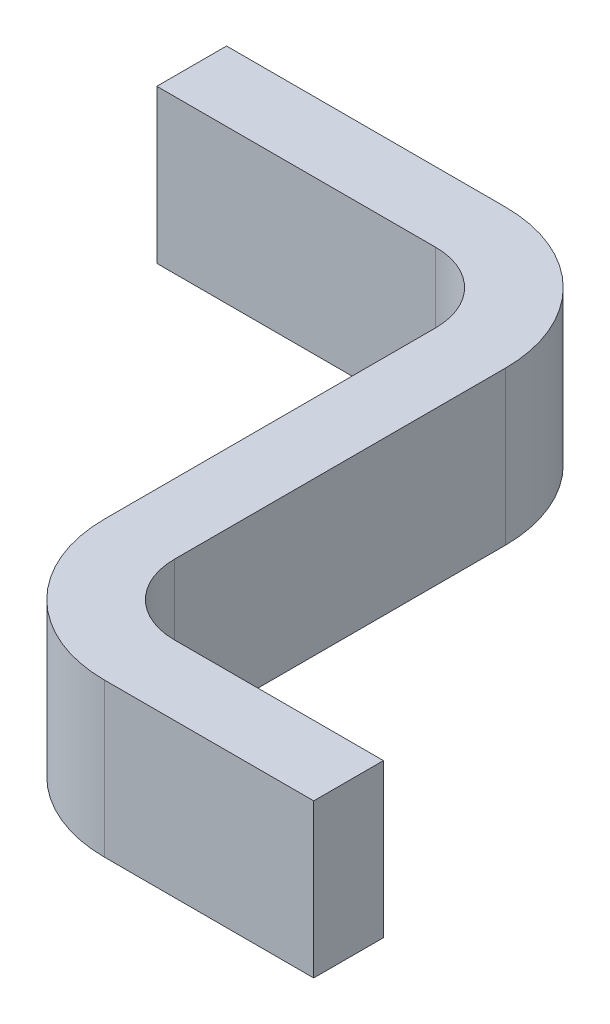
ISO-10303-21;
HEADER;
FILE_DESCRIPTION(('STEP AP214'),'2;1');
FILE_NAME('part.step','',(''),(''),'','','');
FILE_SCHEMA(('AUTOMOTIVE_DESIGN { 1 0 10303 214 1 1 1 1 }'));
ENDSEC;
DATA;
#1=APPLICATION_CONTEXT('core data for automotive mechanical design processes');
#2=APPLICATION_PROTOCOL_DEFINITION('international standard','automotive_design',2000,#1);
#3=PRODUCT_CONTEXT('',#1,'mechanical');
#4=PRODUCT('Part','Part','',(#3));
#5=PRODUCT_RELATED_PRODUCT_CATEGORY('part','',(#4));
#6=PRODUCT_DEFINITION_FORMATION('','',#4);
#7=PRODUCT_DEFINITION_CONTEXT('part definition',#1,'design');
#8=PRODUCT_DEFINITION('design','',#6,#7);
#9=PRODUCT_DEFINITION_SHAPE('','',#8);
#10=(LENGTH_UNIT() NAMED_UNIT(*) SI_UNIT(.MILLI.,.METRE.));
#11=(NAMED_UNIT(*) PLANE_ANGLE_UNIT() SI_UNIT($,.RADIAN.));
#12=(NAMED_UNIT(*) SI_UNIT($,.STERADIAN.) SOLID_ANGLE_UNIT());
#13=UNCERTAINTY_MEASURE_WITH_UNIT(LENGTH_MEASURE(1.E-05),#10,'distance_accuracy_value','');
#14=(GEOMETRIC_REPRESENTATION_CONTEXT(3) GLOBAL_UNCERTAINTY_ASSIGNED_CONTEXT((#13)) GLOBAL_UNIT_ASSIGNED_CONTEXT((#10,
#11,#12)) REPRESENTATION_CONTEXT('',''));
#15=CARTESIAN_POINT('',(0.,0.,0.));
#16=DIRECTION('',(0.,0.,1.));
#17=DIRECTION('',(1.,0.,0.));
#18=AXIS2_PLACEMENT_3D('',#15,#16,#17);
#19=CARTESIAN_POINT('',(-4.,2.86,0.675));
#20=DIRECTION('',(0.,-1.,0.));
#21=DIRECTION('',(1.,0.,0.));
#22=AXIS2_PLACEMENT_3D('',#19,#20,#21);
#23=PLANE('',#22);
#24=CARTESIAN_POINT('',(-3.8,2.86,0.675));
#25=DIRECTION('',(0.,1.,0.));
#26=DIRECTION('',(-1.,0.,0.));
#27=AXIS2_PLACEMENT_3D('',#24,#25,#26);
#28=CIRCLE('',#27,0.2);
#29=CARTESIAN_POINT('',(-3.8,2.86,0.875));
#30=VERTEX_POINT('',#29);
#31=CARTESIAN_POINT('',(-4.,2.86,0.675));
#32=VERTEX_POINT('',#31);
#33=EDGE_CURVE('E150',#30,#32,#28,.F.);
#34=ORIENTED_EDGE('',*,*,#33,.F.);
#35=DIRECTION('',(-1.,0.,0.));
#36=VECTOR('',#35,1.);
#37=CARTESIAN_POINT('',(-3.5,2.86,0.875));
#38=LINE('',#37,#36);
#39=CARTESIAN_POINT('',(-3.5,2.86,0.875));
#40=VERTEX_POINT('',#39);
#41=EDGE_CURVE('E147',#30,#40,#38,.F.);
#42=ORIENTED_EDGE('',*,*,#41,.T.);
#43=DIRECTION('',(0.,0.,1.));
#44=VECTOR('',#43,1.);
#45=CARTESIAN_POINT('',(-3.5,2.86,0.775));
#46=LINE('',#45,#44);
#47=CARTESIAN_POINT('',(-3.5,2.86,0.775));
#48=VERTEX_POINT('',#47);
#49=EDGE_CURVE('E141',#48,#40,#46,.T.);
#50=ORIENTED_EDGE('',*,*,#49,.F.);
#51=DIRECTION('',(1.,0.,0.));
#52=VECTOR('',#51,1.);
#53=CARTESIAN_POINT('',(-3.5,2.86,0.775));
#54=LINE('',#53,#52);
#55=CARTESIAN_POINT('',(-3.8,2.86,0.775));
#56=VERTEX_POINT('',#55);
#57=EDGE_CURVE('E115',#48,#56,#54,.F.);
#58=ORIENTED_EDGE('',*,*,#57,.T.);
#59=CARTESIAN_POINT('',(-3.8,2.86,0.675));
#60=DIRECTION('',(0.,1.,0.));
#61=DIRECTION('',(-1.,0.,0.));
#62=AXIS2_PLACEMENT_3D('',#59,#60,#61);
#63=CIRCLE('',#62,0.1);
#64=CARTESIAN_POINT('',(-3.9,2.86,0.675));
#65=VERTEX_POINT('',#64);
#66=EDGE_CURVE('E215',#56,#65,#63,.F.);
#67=ORIENTED_EDGE('',*,*,#66,.T.);
#68=DIRECTION('',(0.,0.,1.));
#69=VECTOR('',#68,1.);
#70=CARTESIAN_POINT('',(-3.9,2.86,0.675));
#71=LINE('',#70,#69);
#72=CARTESIAN_POINT('',(-3.9,2.86,0.2));
#73=VERTEX_POINT('',#72);
#74=EDGE_CURVE('E181',#65,#73,#71,.F.);
#75=ORIENTED_EDGE('',*,*,#74,.T.);
#76=CARTESIAN_POINT('',(-4.1,2.86,0.2));
#77=DIRECTION('',(0.,-1.,0.));
#78=DIRECTION('',(1.,0.,0.));
#79=AXIS2_PLACEMENT_3D('',#76,#77,#78);
#80=CIRCLE('',#79,0.2);
#81=CARTESIAN_POINT('',(-4.1,2.86,0.));
#82=VERTEX_POINT('',#81);
#83=EDGE_CURVE('E20',#82,#73,#80,.T.);
#84=ORIENTED_EDGE('',*,*,#83,.F.);
#85=DIRECTION('',(1.,0.,0.));
#86=VECTOR('',#85,1.);
#87=CARTESIAN_POINT('',(-4.1,2.86,0.));
#88=LINE('',#87,#86);
#89=CARTESIAN_POINT('',(-4.5,2.86,0.));
#90=VERTEX_POINT('',#89);
#91=EDGE_CURVE('E91',#82,#90,#88,.F.);
#92=ORIENTED_EDGE('',*,*,#91,.T.);
#93=DIRECTION('',(0.,0.,1.));
#94=VECTOR('',#93,1.);
#95=CARTESIAN_POINT('',(-4.5,2.86,0.));
#96=LINE('',#95,#94);
#97=CARTESIAN_POINT('',(-4.5,2.86,0.1));
#98=VERTEX_POINT('',#97);
#99=EDGE_CURVE('E163',#90,#98,#96,.T.);
#100=ORIENTED_EDGE('',*,*,#99,.T.);
#101=DIRECTION('',(-1.,0.,0.));
#102=VECTOR('',#101,1.);
#103=CARTESIAN_POINT('',(-4.1,2.86,0.1));
#104=LINE('',#103,#102);
#105=CARTESIAN_POINT('',(-4.1,2.86,0.1));
#106=VERTEX_POINT('',#105);
#107=EDGE_CURVE('E159',#98,#106,#104,.F.);
#108=ORIENTED_EDGE('',*,*,#107,.T.);
#109=CARTESIAN_POINT('',(-4.1,2.86,0.2));
#110=DIRECTION('',(0.,-1.,0.));
#111=DIRECTION('',(1.,0.,0.));
#112=AXIS2_PLACEMENT_3D('',#109,#110,#111);
#113=CIRCLE('',#112,0.1);
#114=CARTESIAN_POINT('',(-4.,2.86,0.2));
#115=VERTEX_POINT('',#114);
#116=EDGE_CURVE('E155',#106,#115,#113,.T.);
#117=ORIENTED_EDGE('',*,*,#116,.T.);
#118=DIRECTION('',(0.,0.,1.));
#119=VECTOR('',#118,1.);
#120=CARTESIAN_POINT('',(-4.,2.86,0.675));
#121=LINE('',#120,#119);
#122=EDGE_CURVE('E154',#115,#32,#121,.T.);
#123=ORIENTED_EDGE('',*,*,#122,.T.);
#124=EDGE_LOOP('',(#34,#42,#50,#58,#67,#75,#84,#92,#100,#108,#117,#123));
#125=FACE_BOUND('',#124,.T.);
#126=ADVANCED_FACE('F17',(#125),#23,.F.);
#127=CARTESIAN_POINT('',(-4.1,2.86,0.2));
#128=DIRECTION('',(0.,-1.,0.));
#129=DIRECTION('',(1.,0.,0.));
#130=AXIS2_PLACEMENT_3D('',#127,#128,#129);
#131=CYLINDRICAL_SURFACE('',#130,0.2);
#132=CARTESIAN_POINT('',(-4.1,2.64,0.2));
#133=DIRECTION('',(0.,-1.,0.));
#134=DIRECTION('',(1.,0.,0.));
#135=AXIS2_PLACEMENT_3D('',#132,#133,#134);
#136=CIRCLE('',#135,0.2);
#137=CARTESIAN_POINT('',(-3.9,2.64,0.2));
#138=VERTEX_POINT('',#137);
#139=CARTESIAN_POINT('',(-4.1,2.64,0.));
#140=VERTEX_POINT('',#139);
#141=EDGE_CURVE('E183',#138,#140,#136,.F.);
#142=ORIENTED_EDGE('',*,*,#141,.T.);
#143=DIRECTION('',(0.,1.,0.));
#144=VECTOR('',#143,1.);
#145=CARTESIAN_POINT('',(-4.1,2.86,0.));
#146=LINE('',#145,#144);
#147=EDGE_CURVE('E178',#140,#82,#146,.T.);
#148=ORIENTED_EDGE('',*,*,#147,.T.);
#149=ORIENTED_EDGE('',*,*,#83,.T.);
#150=DIRECTION('',(0.,-1.,0.));
#151=VECTOR('',#150,1.);
#152=CARTESIAN_POINT('',(-3.9,2.86,0.2));
#153=LINE('',#152,#151);
#154=EDGE_CURVE('E217',#73,#138,#153,.T.);
#155=ORIENTED_EDGE('',*,*,#154,.T.);
#156=EDGE_LOOP('',(#142,#148,#149,#155));
#157=FACE_BOUND('',#156,.T.);
#158=ADVANCED_FACE('F254',(#157),#131,.T.);
#159=CARTESIAN_POINT('',(-4.1,2.86,0.));
#160=DIRECTION('',(0.,0.,1.));
#161=DIRECTION('',(1.,0.,0.));
#162=AXIS2_PLACEMENT_3D('',#159,#160,#161);
#163=PLANE('',#162);
#164=ORIENTED_EDGE('',*,*,#147,.F.);
#165=DIRECTION('',(-1.,0.,0.));
#166=VECTOR('',#165,1.);
#167=CARTESIAN_POINT('',(-3.9,2.64,0.));
#168=LINE('',#167,#166);
#169=CARTESIAN_POINT('',(-4.5,2.64,0.));
#170=VERTEX_POINT('',#169);
#171=EDGE_CURVE('E170',#140,#170,#168,.T.);
#172=ORIENTED_EDGE('',*,*,#171,.T.);
#173=DIRECTION('',(0.,1.,0.));
#174=VECTOR('',#173,1.);
#175=CARTESIAN_POINT('',(-4.5,2.86,0.));
#176=LINE('',#175,#174);
#177=EDGE_CURVE('E173',#170,#90,#176,.T.);
#178=ORIENTED_EDGE('',*,*,#177,.T.);
#179=ORIENTED_EDGE('',*,*,#91,.F.);
#180=EDGE_LOOP('',(#164,#172,#178,#179));
#181=FACE_BOUND('',#180,.T.);
#182=ADVANCED_FACE('F257',(#181),#163,.F.);
#183=CARTESIAN_POINT('',(-4.5,2.86,0.));
#184=DIRECTION('',(1.,0.,0.));
#185=DIRECTION('',(0.,1.,0.));
#186=AXIS2_PLACEMENT_3D('',#183,#184,#185);
#187=PLANE('',#186);
#188=DIRECTION('',(0.,1.,0.));
#189=VECTOR('',#188,1.);
#190=CARTESIAN_POINT('',(-4.5,2.64,0.1));
#191=LINE('',#190,#189);
#192=CARTESIAN_POINT('',(-4.5,2.64,0.1));
#193=VERTEX_POINT('',#192);
#194=EDGE_CURVE('E160',#193,#98,#191,.T.);
#195=ORIENTED_EDGE('',*,*,#194,.T.);
#196=ORIENTED_EDGE('',*,*,#99,.F.);
#197=ORIENTED_EDGE('',*,*,#177,.F.);
#198=DIRECTION('',(0.,0.,1.));
#199=VECTOR('',#198,1.);
#200=CARTESIAN_POINT('',(-4.5,2.64,0.675));
#201=LINE('',#200,#199);
#202=EDGE_CURVE('E166',#170,#193,#201,.T.);
#203=ORIENTED_EDGE('',*,*,#202,.T.);
#204=EDGE_LOOP('',(#195,#196,#197,#203));
#205=FACE_BOUND('',#204,.T.);
#206=ADVANCED_FACE('F259',(#205),#187,.F.);
#207=CARTESIAN_POINT('',(-4.1,2.64,0.1));
#208=DIRECTION('',(0.,0.,-1.));
#209=DIRECTION('',(-1.,0.,0.));
#210=AXIS2_PLACEMENT_3D('',#207,#208,#209);
#211=PLANE('',#210);
#212=DIRECTION('',(0.,-1.,0.));
#213=VECTOR('',#212,1.);
#214=CARTESIAN_POINT('',(-4.1,2.64,0.1));
#215=LINE('',#214,#213);
#216=CARTESIAN_POINT('',(-4.1,2.64,0.1));
#217=VERTEX_POINT('',#216);
#218=EDGE_CURVE('E156',#217,#106,#215,.F.);
#219=ORIENTED_EDGE('',*,*,#218,.T.);
#220=ORIENTED_EDGE('',*,*,#107,.F.);
#221=ORIENTED_EDGE('',*,*,#194,.F.);
#222=DIRECTION('',(-1.,0.,0.));
#223=VECTOR('',#222,1.);
#224=CARTESIAN_POINT('',(-3.9,2.64,0.1));
#225=LINE('',#224,#223);
#226=EDGE_CURVE('E169',#193,#217,#225,.F.);
#227=ORIENTED_EDGE('',*,*,#226,.T.);
#228=EDGE_LOOP('',(#219,#220,#221,#227));
#229=FACE_BOUND('',#228,.T.);
#230=ADVANCED_FACE('F234',(#229),#211,.F.);
#231=CARTESIAN_POINT('',(-4.1,2.64,0.2));
#232=DIRECTION('',(0.,-1.,0.));
#233=DIRECTION('',(1.,0.,0.));
#234=AXIS2_PLACEMENT_3D('',#231,#232,#233);
#235=CYLINDRICAL_SURFACE('',#234,0.1);
#236=DIRECTION('',(0.,1.,0.));
#237=VECTOR('',#236,1.);
#238=CARTESIAN_POINT('',(-4.,2.64,0.2));
#239=LINE('',#238,#237);
#240=CARTESIAN_POINT('',(-4.,2.64,0.2));
#241=VERTEX_POINT('',#240);
#242=EDGE_CURVE('E151',#241,#115,#239,.T.);
#243=ORIENTED_EDGE('',*,*,#242,.T.);
#244=ORIENTED_EDGE('',*,*,#116,.F.);
#245=ORIENTED_EDGE('',*,*,#218,.F.);
#246=CARTESIAN_POINT('',(-4.1,2.64,0.2));
#247=DIRECTION('',(0.,-1.,0.));
#248=DIRECTION('',(1.,0.,0.));
#249=AXIS2_PLACEMENT_3D('',#246,#247,#248);
#250=CIRCLE('',#249,0.1);
#251=EDGE_CURVE('E210',#217,#241,#250,.T.);
#252=ORIENTED_EDGE('',*,*,#251,.T.);
#253=EDGE_LOOP('',(#243,#244,#245,#252));
#254=FACE_BOUND('',#253,.T.);
#255=ADVANCED_FACE('F227',(#254),#235,.F.);
#256=CARTESIAN_POINT('',(-4.,2.64,0.675));
#257=DIRECTION('',(1.,0.,0.));
#258=DIRECTION('',(0.,1.,0.));
#259=AXIS2_PLACEMENT_3D('',#256,#257,#258);
#260=PLANE('',#259);
#261=DIRECTION('',(0.,1.,0.));
#262=VECTOR('',#261,1.);
#263=CARTESIAN_POINT('',(-4.,2.64,0.675));
#264=LINE('',#263,#262);
#265=CARTESIAN_POINT('',(-4.,2.64,0.675));
#266=VERTEX_POINT('',#265);
#267=EDGE_CURVE('E148',#32,#266,#264,.F.);
#268=ORIENTED_EDGE('',*,*,#267,.F.);
#269=ORIENTED_EDGE('',*,*,#122,.F.);
#270=ORIENTED_EDGE('',*,*,#242,.F.);
#271=DIRECTION('',(0.,0.,1.));
#272=VECTOR('',#271,1.);
#273=CARTESIAN_POINT('',(-4.,2.64,0.675));
#274=LINE('',#273,#272);
#275=EDGE_CURVE('E209',#241,#266,#274,.T.);
#276=ORIENTED_EDGE('',*,*,#275,.T.);
#277=EDGE_LOOP('',(#268,#269,#270,#276));
#278=FACE_BOUND('',#277,.T.);
#279=ADVANCED_FACE('F224',(#278),#260,.F.);
#280=CARTESIAN_POINT('',(-3.80000000000001,2.64000000000001,0.675));
#281=DIRECTION('',(0.,1.,0.));
#282=DIRECTION('',(-1.,0.,0.));
#283=AXIS2_PLACEMENT_3D('',#280,#281,#282);
#284=CYLINDRICAL_SURFACE('',#283,0.2);
#285=ORIENTED_EDGE('',*,*,#33,.T.);
#286=ORIENTED_EDGE('',*,*,#267,.T.);
#287=CARTESIAN_POINT('',(-3.80000000000001,2.64000000000001,0.675));
#288=DIRECTION('',(0.,1.,0.));
#289=DIRECTION('',(-1.,0.,0.));
#290=AXIS2_PLACEMENT_3D('',#287,#288,#289);
#291=CIRCLE('',#290,0.2);
#292=CARTESIAN_POINT('',(-3.80000000000001,2.64000000000001,0.875));
#293=VERTEX_POINT('',#292);
#294=EDGE_CURVE('E133',#266,#293,#291,.T.);
#295=ORIENTED_EDGE('',*,*,#294,.T.);
#296=DIRECTION('',(0.,1.,0.));
#297=VECTOR('',#296,1.);
#298=CARTESIAN_POINT('',(-3.80000000000001,2.64000000000001,0.875));
#299=LINE('',#298,#297);
#300=EDGE_CURVE('E144',#293,#30,#299,.T.);
#301=ORIENTED_EDGE('',*,*,#300,.T.);
#302=EDGE_LOOP('',(#285,#286,#295,#301));
#303=FACE_BOUND('',#302,.T.);
#304=ADVANCED_FACE('F285',(#303),#284,.T.);
#305=CARTESIAN_POINT('',(-3.5,2.64,0.875));
#306=DIRECTION('',(0.,0.,-1.));
#307=DIRECTION('',(-1.,0.,0.));
#308=AXIS2_PLACEMENT_3D('',#305,#306,#307);
#309=PLANE('',#308);
#310=DIRECTION('',(0.,1.,0.));
#311=VECTOR('',#310,1.);
#312=CARTESIAN_POINT('',(-3.5,2.86,0.875));
#313=LINE('',#312,#311);
#314=CARTESIAN_POINT('',(-3.5,2.64,0.875));
#315=VERTEX_POINT('',#314);
#316=EDGE_CURVE('E118',#40,#315,#313,.F.);
#317=ORIENTED_EDGE('',*,*,#316,.F.);
#318=ORIENTED_EDGE('',*,*,#41,.F.);
#319=ORIENTED_EDGE('',*,*,#300,.F.);
#320=DIRECTION('',(-1.,0.,0.));
#321=VECTOR('',#320,1.);
#322=CARTESIAN_POINT('',(-3.9,2.64,0.875));
#323=LINE('',#322,#321);
#324=EDGE_CURVE('E131',#293,#315,#323,.F.);
#325=ORIENTED_EDGE('',*,*,#324,.T.);
#326=EDGE_LOOP('',(#317,#318,#319,#325));
#327=FACE_BOUND('',#326,.T.);
#328=ADVANCED_FACE('F282',(#327),#309,.F.);
#329=CARTESIAN_POINT('',(-3.5,2.86,0.775));
#330=DIRECTION('',(1.,0.,0.));
#331=DIRECTION('',(0.,1.,0.));
#332=AXIS2_PLACEMENT_3D('',#329,#330,#331);
#333=PLANE('',#332);
#334=ORIENTED_EDGE('',*,*,#49,.T.);
#335=ORIENTED_EDGE('',*,*,#316,.T.);
#336=DIRECTION('',(0.,0.,1.));
#337=VECTOR('',#336,1.);
#338=CARTESIAN_POINT('',(-3.5,2.64,0.675));
#339=LINE('',#338,#337);
#340=CARTESIAN_POINT('',(-3.5,2.64,0.775));
#341=VERTEX_POINT('',#340);
#342=EDGE_CURVE('E125',#315,#341,#339,.F.);
#343=ORIENTED_EDGE('',*,*,#342,.T.);
#344=DIRECTION('',(0.,1.,0.));
#345=VECTOR('',#344,1.);
#346=CARTESIAN_POINT('',(-3.5,2.86,0.775));
#347=LINE('',#346,#345);
#348=EDGE_CURVE('E110',#341,#48,#347,.T.);
#349=ORIENTED_EDGE('',*,*,#348,.T.);
#350=EDGE_LOOP('',(#334,#335,#343,#349));
#351=FACE_BOUND('',#350,.T.);
#352=ADVANCED_FACE('F129',(#351),#333,.T.);
#353=CARTESIAN_POINT('',(-3.5,2.86,0.775));
#354=DIRECTION('',(0.,0.,1.));
#355=DIRECTION('',(1.,0.,0.));
#356=AXIS2_PLACEMENT_3D('',#353,#354,#355);
#357=PLANE('',#356);
#358=ORIENTED_EDGE('',*,*,#348,.F.);
#359=DIRECTION('',(-1.,0.,0.));
#360=VECTOR('',#359,1.);
#361=CARTESIAN_POINT('',(-3.9,2.64,0.775));
#362=LINE('',#361,#360);
#363=CARTESIAN_POINT('',(-3.80000000000001,2.64000000000001,0.775));
#364=VERTEX_POINT('',#363);
#365=EDGE_CURVE('E114',#341,#364,#362,.T.);
#366=ORIENTED_EDGE('',*,*,#365,.T.);
#367=DIRECTION('',(0.,1.,0.));
#368=VECTOR('',#367,1.);
#369=CARTESIAN_POINT('',(-3.8,2.86,0.775));
#370=LINE('',#369,#368);
#371=EDGE_CURVE('E185',#364,#56,#370,.T.);
#372=ORIENTED_EDGE('',*,*,#371,.T.);
#373=ORIENTED_EDGE('',*,*,#57,.F.);
#374=EDGE_LOOP('',(#358,#366,#372,#373));
#375=FACE_BOUND('',#374,.T.);
#376=ADVANCED_FACE('F112',(#375),#357,.F.);
#377=CARTESIAN_POINT('',(-3.8,2.86,0.675));
#378=DIRECTION('',(0.,1.,0.));
#379=DIRECTION('',(-1.,0.,0.));
#380=AXIS2_PLACEMENT_3D('',#377,#378,#379);
#381=CYLINDRICAL_SURFACE('',#380,0.1);
#382=ORIENTED_EDGE('',*,*,#371,.F.);
#383=CARTESIAN_POINT('',(-3.80000000000001,2.64000000000001,0.675));
#384=DIRECTION('',(0.,1.,0.));
#385=DIRECTION('',(-1.,0.,0.));
#386=AXIS2_PLACEMENT_3D('',#383,#384,#385);
#387=CIRCLE('',#386,0.1);
#388=CARTESIAN_POINT('',(-3.9,2.64,0.675));
#389=VERTEX_POINT('',#388);
#390=EDGE_CURVE('E26',#364,#389,#387,.F.);
#391=ORIENTED_EDGE('',*,*,#390,.T.);
#392=DIRECTION('',(0.,-1.,0.));
#393=VECTOR('',#392,1.);
#394=CARTESIAN_POINT('',(-3.9,2.86,0.675));
#395=LINE('',#394,#393);
#396=EDGE_CURVE('E34',#389,#65,#395,.F.);
#397=ORIENTED_EDGE('',*,*,#396,.T.);
#398=ORIENTED_EDGE('',*,*,#66,.F.);
#399=EDGE_LOOP('',(#382,#391,#397,#398));
#400=FACE_BOUND('',#399,.T.);
#401=ADVANCED_FACE('F250',(#400),#381,.F.);
#402=CARTESIAN_POINT('',(-3.9,2.86,0.675));
#403=DIRECTION('',(-1.,0.,0.));
#404=DIRECTION('',(0.,-1.,0.));
#405=AXIS2_PLACEMENT_3D('',#402,#403,#404);
#406=PLANE('',#405);
#407=ORIENTED_EDGE('',*,*,#396,.F.);
#408=DIRECTION('',(0.,0.,1.));
#409=VECTOR('',#408,1.);
#410=CARTESIAN_POINT('',(-3.9,2.64,0.675));
#411=LINE('',#410,#409);
#412=EDGE_CURVE('E11',#389,#138,#411,.F.);
#413=ORIENTED_EDGE('',*,*,#412,.T.);
#414=ORIENTED_EDGE('',*,*,#154,.F.);
#415=ORIENTED_EDGE('',*,*,#74,.F.);
#416=EDGE_LOOP('',(#407,#413,#414,#415));
#417=FACE_BOUND('',#416,.T.);
#418=ADVANCED_FACE('F252',(#417),#406,.F.);
#419=CARTESIAN_POINT('',(-3.9,2.64,0.675));
#420=DIRECTION('',(0.,1.,0.));
#421=DIRECTION('',(-1.,0.,0.));
#422=AXIS2_PLACEMENT_3D('',#419,#420,#421);
#423=PLANE('',#422);
#424=ORIENTED_EDGE('',*,*,#390,.F.);
#425=ORIENTED_EDGE('',*,*,#365,.F.);
#426=ORIENTED_EDGE('',*,*,#342,.F.);
#427=ORIENTED_EDGE('',*,*,#324,.F.);
#428=ORIENTED_EDGE('',*,*,#294,.F.);
#429=ORIENTED_EDGE('',*,*,#275,.F.);
#430=ORIENTED_EDGE('',*,*,#251,.F.);
#431=ORIENTED_EDGE('',*,*,#226,.F.);
#432=ORIENTED_EDGE('',*,*,#202,.F.);
#433=ORIENTED_EDGE('',*,*,#171,.F.);
#434=ORIENTED_EDGE('',*,*,#141,.F.);
#435=ORIENTED_EDGE('',*,*,#412,.F.);
#436=EDGE_LOOP('',(#424,#425,#426,#427,#428,#429,#430,#431,#432,#433,#434,#435));
#437=FACE_BOUND('',#436,.T.);
#438=ADVANCED_FACE('F123',(#437),#423,.F.);
#439=CLOSED_SHELL('',(#126,#158,#182,#206,#230,#255,#279,#304,#328,#352,#376,#401,#418,#438));
#440=MANIFOLD_SOLID_BREP('B1',#439);
#441=ADVANCED_BREP_SHAPE_REPRESENTATION('',(#18,#440),#14);
#442=SHAPE_DEFINITION_REPRESENTATION(#9,#441);
ENDSEC;
END-ISO-10303-21;
